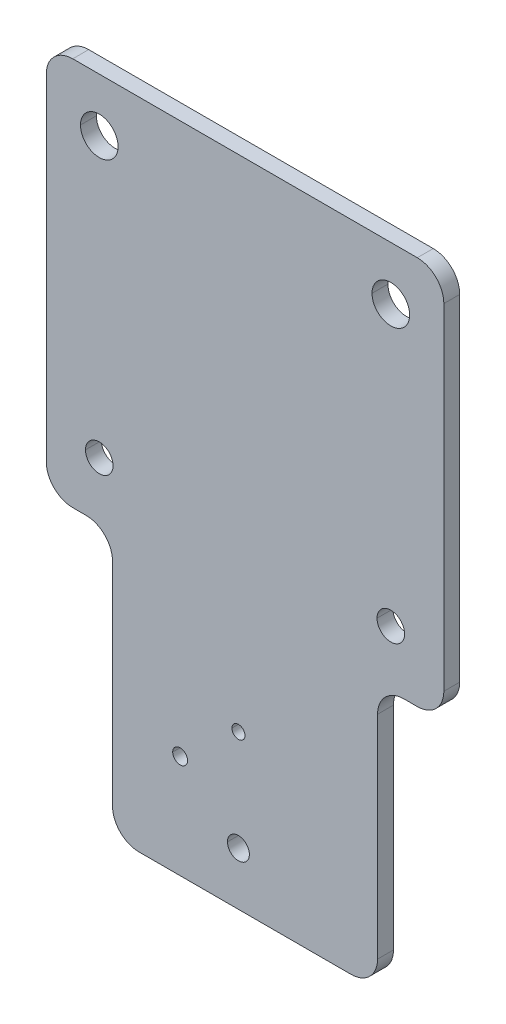
ISO-10303-21;
HEADER;
FILE_DESCRIPTION(('STEP AP214'),'2;1');
FILE_NAME('part.step','',(''),(''),'','','');
FILE_SCHEMA(('AUTOMOTIVE_DESIGN { 1 0 10303 214 1 1 1 1 }'));
ENDSEC;
DATA;
#1=APPLICATION_CONTEXT('core data for automotive mechanical design processes');
#2=APPLICATION_PROTOCOL_DEFINITION('international standard','automotive_design',2000,#1);
#3=PRODUCT_CONTEXT('',#1,'mechanical');
#4=PRODUCT('Part','Part','',(#3));
#5=PRODUCT_RELATED_PRODUCT_CATEGORY('part','',(#4));
#6=PRODUCT_DEFINITION_FORMATION('','',#4);
#7=PRODUCT_DEFINITION_CONTEXT('part definition',#1,'design');
#8=PRODUCT_DEFINITION('design','',#6,#7);
#9=PRODUCT_DEFINITION_SHAPE('','',#8);
#10=(LENGTH_UNIT() NAMED_UNIT(*) SI_UNIT(.MILLI.,.METRE.));
#11=(NAMED_UNIT(*) PLANE_ANGLE_UNIT() SI_UNIT($,.RADIAN.));
#12=(NAMED_UNIT(*) SI_UNIT($,.STERADIAN.) SOLID_ANGLE_UNIT());
#13=UNCERTAINTY_MEASURE_WITH_UNIT(LENGTH_MEASURE(1.E-05),#10,'distance_accuracy_value','');
#14=(GEOMETRIC_REPRESENTATION_CONTEXT(3) GLOBAL_UNCERTAINTY_ASSIGNED_CONTEXT((#13)) GLOBAL_UNIT_ASSIGNED_CONTEXT((#10,
#11,#12)) REPRESENTATION_CONTEXT('',''));
#15=CARTESIAN_POINT('',(0.,0.,0.));
#16=DIRECTION('',(0.,0.,1.));
#17=DIRECTION('',(1.,0.,0.));
#18=AXIS2_PLACEMENT_3D('',#15,#16,#17);
#19=CARTESIAN_POINT('',(-25.,-12.3885820247537,3.));
#20=DIRECTION('',(0.,0.,-1.));
#21=DIRECTION('',(-1.,0.,0.));
#22=AXIS2_PLACEMENT_3D('',#19,#20,#21);
#23=CYLINDRICAL_SURFACE('',#22,5.);
#24=CARTESIAN_POINT('',(-25.,-12.3885820247537,3.));
#25=DIRECTION('',(0.,0.,1.));
#26=DIRECTION('',(1.,0.,0.));
#27=AXIS2_PLACEMENT_3D('',#24,#25,#26);
#28=CIRCLE('',#27,5.);
#29=CARTESIAN_POINT('',(-25.,-7.38858202475368,3.));
#30=VERTEX_POINT('',#29);
#31=CARTESIAN_POINT('',(-30.,-12.3885820247537,3.));
#32=VERTEX_POINT('',#31);
#33=EDGE_CURVE('E261',#30,#32,#28,.T.);
#34=ORIENTED_EDGE('',*,*,#33,.F.);
#35=DIRECTION('',(0.,0.,1.));
#36=VECTOR('',#35,1.);
#37=CARTESIAN_POINT('',(-25.,-7.38858202475368,3.));
#38=LINE('',#37,#36);
#39=CARTESIAN_POINT('',(-25.,-7.38858202475368,0.));
#40=VERTEX_POINT('',#39);
#41=EDGE_CURVE('E377',#40,#30,#38,.T.);
#42=ORIENTED_EDGE('',*,*,#41,.F.);
#43=CARTESIAN_POINT('',(-25.,-12.3885820247537,0.));
#44=DIRECTION('',(0.,0.,-1.));
#45=DIRECTION('',(1.,0.,0.));
#46=AXIS2_PLACEMENT_3D('',#43,#44,#45);
#47=CIRCLE('',#46,5.);
#48=CARTESIAN_POINT('',(-30.,-12.3885820247537,0.));
#49=VERTEX_POINT('',#48);
#50=EDGE_CURVE('E316',#49,#40,#47,.T.);
#51=ORIENTED_EDGE('',*,*,#50,.F.);
#52=DIRECTION('',(0.,0.,-1.));
#53=VECTOR('',#52,1.);
#54=CARTESIAN_POINT('',(-30.,-12.3885820247537,3.));
#55=LINE('',#54,#53);
#56=EDGE_CURVE('E381',#32,#49,#55,.T.);
#57=ORIENTED_EDGE('',*,*,#56,.F.);
#58=EDGE_LOOP('',(#34,#42,#51,#57));
#59=FACE_BOUND('',#58,.T.);
#60=ADVANCED_FACE('F17',(#59),#23,.T.);
#61=CARTESIAN_POINT('',(40.,-12.3885820247537,3.));
#62=DIRECTION('',(0.,0.,-1.));
#63=DIRECTION('',(-1.,0.,0.));
#64=AXIS2_PLACEMENT_3D('',#61,#62,#63);
#65=CYLINDRICAL_SURFACE('',#64,5.);
#66=CARTESIAN_POINT('',(40.,-12.3885820247537,3.));
#67=DIRECTION('',(0.,0.,1.));
#68=DIRECTION('',(1.,0.,0.));
#69=AXIS2_PLACEMENT_3D('',#66,#67,#68);
#70=CIRCLE('',#69,5.);
#71=CARTESIAN_POINT('',(45.,-12.3885820247537,3.));
#72=VERTEX_POINT('',#71);
#73=CARTESIAN_POINT('',(40.,-7.38858202475368,3.));
#74=VERTEX_POINT('',#73);
#75=EDGE_CURVE('E237',#72,#74,#70,.T.);
#76=ORIENTED_EDGE('',*,*,#75,.F.);
#77=DIRECTION('',(0.,0.,1.));
#78=VECTOR('',#77,1.);
#79=CARTESIAN_POINT('',(45.,-12.3885820247537,3.));
#80=LINE('',#79,#78);
#81=CARTESIAN_POINT('',(45.,-12.3885820247537,0.));
#82=VERTEX_POINT('',#81);
#83=EDGE_CURVE('E222',#82,#72,#80,.T.);
#84=ORIENTED_EDGE('',*,*,#83,.F.);
#85=CARTESIAN_POINT('',(40.,-12.3885820247537,0.));
#86=DIRECTION('',(0.,0.,-1.));
#87=DIRECTION('',(1.,0.,0.));
#88=AXIS2_PLACEMENT_3D('',#85,#86,#87);
#89=CIRCLE('',#88,5.);
#90=CARTESIAN_POINT('',(40.,-7.38858202475368,0.));
#91=VERTEX_POINT('',#90);
#92=EDGE_CURVE('E298',#91,#82,#89,.T.);
#93=ORIENTED_EDGE('',*,*,#92,.F.);
#94=DIRECTION('',(0.,0.,-1.));
#95=VECTOR('',#94,1.);
#96=CARTESIAN_POINT('',(40.,-7.38858202475368,3.));
#97=LINE('',#96,#95);
#98=EDGE_CURVE('E234',#74,#91,#97,.T.);
#99=ORIENTED_EDGE('',*,*,#98,.F.);
#100=EDGE_LOOP('',(#76,#84,#93,#99));
#101=FACE_BOUND('',#100,.T.);
#102=ADVANCED_FACE('F238',(#101),#65,.T.);
#103=CARTESIAN_POINT('',(40.,-75.7250966848653,3.));
#104=DIRECTION('',(0.,0.,-1.));
#105=DIRECTION('',(-1.,0.,0.));
#106=AXIS2_PLACEMENT_3D('',#103,#104,#105);
#107=CYLINDRICAL_SURFACE('',#106,5.);
#108=CARTESIAN_POINT('',(40.,-75.7250966848653,3.));
#109=DIRECTION('',(0.,0.,1.));
#110=DIRECTION('',(1.,0.,0.));
#111=AXIS2_PLACEMENT_3D('',#108,#109,#110);
#112=CIRCLE('',#111,5.);
#113=CARTESIAN_POINT('',(40.,-80.7250966848653,3.));
#114=VERTEX_POINT('',#113);
#115=CARTESIAN_POINT('',(45.,-75.7250966848653,3.));
#116=VERTEX_POINT('',#115);
#117=EDGE_CURVE('E248',#114,#116,#112,.T.);
#118=ORIENTED_EDGE('',*,*,#117,.F.);
#119=DIRECTION('',(0.,0.,1.));
#120=VECTOR('',#119,1.);
#121=CARTESIAN_POINT('',(40.,-80.7250966848653,3.));
#122=LINE('',#121,#120);
#123=CARTESIAN_POINT('',(40.,-80.7250966848653,0.));
#124=VERTEX_POINT('',#123);
#125=EDGE_CURVE('E106',#124,#114,#122,.T.);
#126=ORIENTED_EDGE('',*,*,#125,.F.);
#127=CARTESIAN_POINT('',(40.,-75.7250966848653,0.));
#128=DIRECTION('',(0.,0.,-1.));
#129=DIRECTION('',(1.,0.,0.));
#130=AXIS2_PLACEMENT_3D('',#127,#128,#129);
#131=CIRCLE('',#130,5.);
#132=CARTESIAN_POINT('',(45.,-75.7250966848653,0.));
#133=VERTEX_POINT('',#132);
#134=EDGE_CURVE('E320',#133,#124,#131,.T.);
#135=ORIENTED_EDGE('',*,*,#134,.F.);
#136=DIRECTION('',(0.,0.,-1.));
#137=VECTOR('',#136,1.);
#138=CARTESIAN_POINT('',(45.,-75.7250966848653,3.));
#139=LINE('',#138,#137);
#140=EDGE_CURVE('E215',#116,#133,#139,.T.);
#141=ORIENTED_EDGE('',*,*,#140,.F.);
#142=EDGE_LOOP('',(#118,#126,#135,#141));
#143=FACE_BOUND('',#142,.T.);
#144=ADVANCED_FACE('F574',(#143),#107,.T.);
#145=CARTESIAN_POINT('',(37.5,-85.7250966848653,3.));
#146=DIRECTION('',(0.,0.,1.));
#147=DIRECTION('',(1.,0.,0.));
#148=AXIS2_PLACEMENT_3D('',#145,#146,#147);
#149=CYLINDRICAL_SURFACE('',#148,5.);
#150=CARTESIAN_POINT('',(37.5,-85.7250966848653,3.));
#151=DIRECTION('',(0.,0.,-1.));
#152=DIRECTION('',(1.,0.,0.));
#153=AXIS2_PLACEMENT_3D('',#150,#151,#152);
#154=CIRCLE('',#153,5.);
#155=CARTESIAN_POINT('',(32.5,-85.7250966848653,3.));
#156=VERTEX_POINT('',#155);
#157=CARTESIAN_POINT('',(37.5,-80.7250966848653,3.));
#158=VERTEX_POINT('',#157);
#159=EDGE_CURVE('E439',#156,#158,#154,.T.);
#160=ORIENTED_EDGE('',*,*,#159,.F.);
#161=DIRECTION('',(0.,0.,1.));
#162=VECTOR('',#161,1.);
#163=CARTESIAN_POINT('',(32.5,-85.7250966848653,3.));
#164=LINE('',#163,#162);
#165=CARTESIAN_POINT('',(32.5,-85.7250966848653,0.));
#166=VERTEX_POINT('',#165);
#167=EDGE_CURVE('E372',#166,#156,#164,.T.);
#168=ORIENTED_EDGE('',*,*,#167,.F.);
#169=CARTESIAN_POINT('',(37.5,-85.7250966848653,0.));
#170=DIRECTION('',(0.,0.,1.));
#171=DIRECTION('',(1.,0.,0.));
#172=AXIS2_PLACEMENT_3D('',#169,#170,#171);
#173=CIRCLE('',#172,5.);
#174=CARTESIAN_POINT('',(37.5,-80.7250966848653,0.));
#175=VERTEX_POINT('',#174);
#176=EDGE_CURVE('E327',#175,#166,#173,.T.);
#177=ORIENTED_EDGE('',*,*,#176,.F.);
#178=DIRECTION('',(0.,0.,-1.));
#179=VECTOR('',#178,1.);
#180=CARTESIAN_POINT('',(37.5,-80.7250966848653,0.));
#181=LINE('',#180,#179);
#182=EDGE_CURVE('E118',#158,#175,#181,.T.);
#183=ORIENTED_EDGE('',*,*,#182,.F.);
#184=EDGE_LOOP('',(#160,#168,#177,#183));
#185=FACE_BOUND('',#184,.T.);
#186=ADVANCED_FACE('F571',(#185),#149,.F.);
#187=CARTESIAN_POINT('',(27.5,-125.725096684865,3.));
#188=DIRECTION('',(0.,0.,-1.));
#189=DIRECTION('',(-1.,0.,0.));
#190=AXIS2_PLACEMENT_3D('',#187,#188,#189);
#191=CYLINDRICAL_SURFACE('',#190,5.);
#192=CARTESIAN_POINT('',(27.5,-125.725096684865,3.));
#193=DIRECTION('',(0.,0.,1.));
#194=DIRECTION('',(1.,0.,0.));
#195=AXIS2_PLACEMENT_3D('',#192,#193,#194);
#196=CIRCLE('',#195,5.);
#197=CARTESIAN_POINT('',(27.5,-130.725096684865,3.));
#198=VERTEX_POINT('',#197);
#199=CARTESIAN_POINT('',(32.5,-125.725096684865,3.));
#200=VERTEX_POINT('',#199);
#201=EDGE_CURVE('E462',#198,#200,#196,.T.);
#202=ORIENTED_EDGE('',*,*,#201,.F.);
#203=DIRECTION('',(0.,0.,1.));
#204=VECTOR('',#203,1.);
#205=CARTESIAN_POINT('',(27.5,-130.725096684865,3.));
#206=LINE('',#205,#204);
#207=CARTESIAN_POINT('',(27.5,-130.725096684865,0.));
#208=VERTEX_POINT('',#207);
#209=EDGE_CURVE('E367',#208,#198,#206,.T.);
#210=ORIENTED_EDGE('',*,*,#209,.F.);
#211=CARTESIAN_POINT('',(27.5,-125.725096684865,0.));
#212=DIRECTION('',(0.,0.,-1.));
#213=DIRECTION('',(1.,0.,0.));
#214=AXIS2_PLACEMENT_3D('',#211,#212,#213);
#215=CIRCLE('',#214,5.);
#216=CARTESIAN_POINT('',(32.5,-125.725096684865,0.));
#217=VERTEX_POINT('',#216);
#218=EDGE_CURVE('E336',#217,#208,#215,.T.);
#219=ORIENTED_EDGE('',*,*,#218,.F.);
#220=DIRECTION('',(0.,0.,-1.));
#221=VECTOR('',#220,1.);
#222=CARTESIAN_POINT('',(32.5,-125.725096684865,3.));
#223=LINE('',#222,#221);
#224=EDGE_CURVE('E40',#200,#217,#223,.T.);
#225=ORIENTED_EDGE('',*,*,#224,.F.);
#226=EDGE_LOOP('',(#202,#210,#219,#225));
#227=FACE_BOUND('',#226,.T.);
#228=ADVANCED_FACE('F582',(#227),#191,.T.);
#229=CARTESIAN_POINT('',(-25.,-75.7250966848653,3.));
#230=DIRECTION('',(0.,0.,-1.));
#231=DIRECTION('',(-1.,0.,0.));
#232=AXIS2_PLACEMENT_3D('',#229,#230,#231);
#233=CYLINDRICAL_SURFACE('',#232,5.);
#234=CARTESIAN_POINT('',(-25.,-75.7250966848653,3.));
#235=DIRECTION('',(0.,0.,1.));
#236=DIRECTION('',(1.,0.,0.));
#237=AXIS2_PLACEMENT_3D('',#234,#235,#236);
#238=CIRCLE('',#237,5.);
#239=CARTESIAN_POINT('',(-30.,-75.7250966848653,3.));
#240=VERTEX_POINT('',#239);
#241=CARTESIAN_POINT('',(-25.,-80.7250966848653,3.));
#242=VERTEX_POINT('',#241);
#243=EDGE_CURVE('E266',#240,#242,#238,.T.);
#244=ORIENTED_EDGE('',*,*,#243,.F.);
#245=DIRECTION('',(0.,0.,1.));
#246=VECTOR('',#245,1.);
#247=CARTESIAN_POINT('',(-30.,-75.7250966848653,3.));
#248=LINE('',#247,#246);
#249=CARTESIAN_POINT('',(-30.,-75.7250966848653,0.));
#250=VERTEX_POINT('',#249);
#251=EDGE_CURVE('E379',#250,#240,#248,.T.);
#252=ORIENTED_EDGE('',*,*,#251,.F.);
#253=CARTESIAN_POINT('',(-25.,-75.7250966848653,0.));
#254=DIRECTION('',(0.,0.,-1.));
#255=DIRECTION('',(1.,0.,0.));
#256=AXIS2_PLACEMENT_3D('',#253,#254,#255);
#257=CIRCLE('',#256,5.);
#258=CARTESIAN_POINT('',(-25.,-80.7250966848653,0.));
#259=VERTEX_POINT('',#258);
#260=EDGE_CURVE('E308',#259,#250,#257,.T.);
#261=ORIENTED_EDGE('',*,*,#260,.F.);
#262=DIRECTION('',(0.,0.,-1.));
#263=VECTOR('',#262,1.);
#264=CARTESIAN_POINT('',(-25.,-80.7250966848653,3.));
#265=LINE('',#264,#263);
#266=EDGE_CURVE('E11',#242,#259,#265,.T.);
#267=ORIENTED_EDGE('',*,*,#266,.F.);
#268=EDGE_LOOP('',(#244,#252,#261,#267));
#269=FACE_BOUND('',#268,.T.);
#270=ADVANCED_FACE('F663',(#269),#233,.T.);
#271=CARTESIAN_POINT('',(-12.5,-125.725096684865,3.));
#272=DIRECTION('',(0.,0.,-1.));
#273=DIRECTION('',(-1.,0.,0.));
#274=AXIS2_PLACEMENT_3D('',#271,#272,#273);
#275=CYLINDRICAL_SURFACE('',#274,5.);
#276=CARTESIAN_POINT('',(-12.5,-125.725096684865,3.));
#277=DIRECTION('',(0.,0.,1.));
#278=DIRECTION('',(1.,0.,0.));
#279=AXIS2_PLACEMENT_3D('',#276,#277,#278);
#280=CIRCLE('',#279,5.);
#281=CARTESIAN_POINT('',(-17.5,-125.725096684865,3.));
#282=VERTEX_POINT('',#281);
#283=CARTESIAN_POINT('',(-12.5,-130.725096684865,3.));
#284=VERTEX_POINT('',#283);
#285=EDGE_CURVE('E463',#282,#284,#280,.T.);
#286=ORIENTED_EDGE('',*,*,#285,.F.);
#287=DIRECTION('',(0.,0.,1.));
#288=VECTOR('',#287,1.);
#289=CARTESIAN_POINT('',(-17.5,-125.725096684865,3.));
#290=LINE('',#289,#288);
#291=CARTESIAN_POINT('',(-17.5,-125.725096684865,0.));
#292=VERTEX_POINT('',#291);
#293=EDGE_CURVE('E361',#292,#282,#290,.T.);
#294=ORIENTED_EDGE('',*,*,#293,.F.);
#295=CARTESIAN_POINT('',(-12.5,-125.725096684865,0.));
#296=DIRECTION('',(0.,0.,-1.));
#297=DIRECTION('',(1.,0.,0.));
#298=AXIS2_PLACEMENT_3D('',#295,#296,#297);
#299=CIRCLE('',#298,5.);
#300=CARTESIAN_POINT('',(-12.5,-130.725096684865,0.));
#301=VERTEX_POINT('',#300);
#302=EDGE_CURVE('E307',#301,#292,#299,.T.);
#303=ORIENTED_EDGE('',*,*,#302,.F.);
#304=DIRECTION('',(0.,0.,-1.));
#305=VECTOR('',#304,1.);
#306=CARTESIAN_POINT('',(-12.5,-130.725096684865,3.));
#307=LINE('',#306,#305);
#308=EDGE_CURVE('E364',#284,#301,#307,.T.);
#309=ORIENTED_EDGE('',*,*,#308,.F.);
#310=EDGE_LOOP('',(#286,#294,#303,#309));
#311=FACE_BOUND('',#310,.T.);
#312=ADVANCED_FACE('F660',(#311),#275,.T.);
#313=CARTESIAN_POINT('',(-22.5,-85.7250966848653,3.));
#314=DIRECTION('',(0.,0.,1.));
#315=DIRECTION('',(1.,0.,0.));
#316=AXIS2_PLACEMENT_3D('',#313,#314,#315);
#317=CYLINDRICAL_SURFACE('',#316,5.);
#318=CARTESIAN_POINT('',(-22.5,-85.7250966848653,3.));
#319=DIRECTION('',(0.,0.,-1.));
#320=DIRECTION('',(1.,0.,0.));
#321=AXIS2_PLACEMENT_3D('',#318,#319,#320);
#322=CIRCLE('',#321,5.);
#323=CARTESIAN_POINT('',(-22.5,-80.7250966848653,3.));
#324=VERTEX_POINT('',#323);
#325=CARTESIAN_POINT('',(-17.5,-85.7250966848653,3.));
#326=VERTEX_POINT('',#325);
#327=EDGE_CURVE('E274',#324,#326,#322,.T.);
#328=ORIENTED_EDGE('',*,*,#327,.F.);
#329=DIRECTION('',(0.,0.,1.));
#330=VECTOR('',#329,1.);
#331=CARTESIAN_POINT('',(-22.5,-80.7250966848653,3.));
#332=LINE('',#331,#330);
#333=CARTESIAN_POINT('',(-22.5,-80.7250966848653,0.));
#334=VERTEX_POINT('',#333);
#335=EDGE_CURVE('E20',#334,#324,#332,.T.);
#336=ORIENTED_EDGE('',*,*,#335,.F.);
#337=CARTESIAN_POINT('',(-22.5,-85.7250966848653,0.));
#338=DIRECTION('',(0.,0.,1.));
#339=DIRECTION('',(1.,0.,0.));
#340=AXIS2_PLACEMENT_3D('',#337,#338,#339);
#341=CIRCLE('',#340,5.);
#342=CARTESIAN_POINT('',(-17.5,-85.7250966848653,0.));
#343=VERTEX_POINT('',#342);
#344=EDGE_CURVE('E306',#343,#334,#341,.T.);
#345=ORIENTED_EDGE('',*,*,#344,.F.);
#346=DIRECTION('',(0.,0.,-1.));
#347=VECTOR('',#346,1.);
#348=CARTESIAN_POINT('',(-17.5,-85.7250966848653,0.));
#349=LINE('',#348,#347);
#350=EDGE_CURVE('E358',#326,#343,#349,.T.);
#351=ORIENTED_EDGE('',*,*,#350,.F.);
#352=EDGE_LOOP('',(#328,#336,#345,#351));
#353=FACE_BOUND('',#352,.T.);
#354=ADVANCED_FACE('F612',(#353),#317,.F.);
#355=CARTESIAN_POINT('',(35.,-17.4750966848652,3.));
#356=DIRECTION('',(0.,0.,-1.));
#357=DIRECTION('',(-1.,0.,0.));
#358=AXIS2_PLACEMENT_3D('',#355,#356,#357);
#359=CYLINDRICAL_SURFACE('',#358,3.55);
#360=DIRECTION('',(0.,0.,-1.));
#361=VECTOR('',#360,1.);
#362=CARTESIAN_POINT('',(38.55,-17.4750966848652,3.));
#363=LINE('',#362,#361);
#364=CARTESIAN_POINT('',(38.55,-17.4750966848652,3.));
#365=VERTEX_POINT('',#364);
#366=CARTESIAN_POINT('',(38.55,-17.4750966848652,0.));
#367=VERTEX_POINT('',#366);
#368=EDGE_CURVE('E400',#365,#367,#363,.T.);
#369=ORIENTED_EDGE('',*,*,#368,.F.);
#370=CARTESIAN_POINT('',(35.,-17.4750966848652,3.));
#371=DIRECTION('',(0.,0.,1.));
#372=DIRECTION('',(-1.,0.,0.));
#373=AXIS2_PLACEMENT_3D('',#370,#371,#372);
#374=CIRCLE('',#373,3.55);
#375=CARTESIAN_POINT('',(31.45,-17.4750966848652,3.));
#376=VERTEX_POINT('',#375);
#377=EDGE_CURVE('E496',#365,#376,#374,.T.);
#378=ORIENTED_EDGE('',*,*,#377,.T.);
#379=DIRECTION('',(0.,0.,-1.));
#380=VECTOR('',#379,1.);
#381=CARTESIAN_POINT('',(31.45,-17.4750966848652,3.));
#382=LINE('',#381,#380);
#383=CARTESIAN_POINT('',(31.45,-17.4750966848652,0.));
#384=VERTEX_POINT('',#383);
#385=EDGE_CURVE('E432',#376,#384,#382,.T.);
#386=ORIENTED_EDGE('',*,*,#385,.T.);
#387=CARTESIAN_POINT('',(35.,-17.4750966848652,0.));
#388=DIRECTION('',(0.,0.,1.));
#389=DIRECTION('',(-1.,0.,0.));
#390=AXIS2_PLACEMENT_3D('',#387,#388,#389);
#391=CIRCLE('',#390,3.55);
#392=EDGE_CURVE('E354',#367,#384,#391,.T.);
#393=ORIENTED_EDGE('',*,*,#392,.F.);
#394=EDGE_LOOP('',(#369,#378,#386,#393));
#395=FACE_BOUND('',#394,.T.);
#396=ADVANCED_FACE('F687',(#395),#359,.F.);
#397=CARTESIAN_POINT('',(-20.,-17.4750966848652,3.));
#398=DIRECTION('',(0.,0.,-1.));
#399=DIRECTION('',(-1.,0.,0.));
#400=AXIS2_PLACEMENT_3D('',#397,#398,#399);
#401=CYLINDRICAL_SURFACE('',#400,3.55);
#402=DIRECTION('',(0.,0.,-1.));
#403=VECTOR('',#402,1.);
#404=CARTESIAN_POINT('',(-16.45,-17.4750966848652,3.));
#405=LINE('',#404,#403);
#406=CARTESIAN_POINT('',(-16.45,-17.4750966848652,3.));
#407=VERTEX_POINT('',#406);
#408=CARTESIAN_POINT('',(-16.45,-17.4750966848652,0.));
#409=VERTEX_POINT('',#408);
#410=EDGE_CURVE('E443',#407,#409,#405,.T.);
#411=ORIENTED_EDGE('',*,*,#410,.F.);
#412=CARTESIAN_POINT('',(-20.,-17.4750966848652,3.));
#413=DIRECTION('',(0.,0.,1.));
#414=DIRECTION('',(-1.,0.,0.));
#415=AXIS2_PLACEMENT_3D('',#412,#413,#414);
#416=CIRCLE('',#415,3.55);
#417=CARTESIAN_POINT('',(-23.55,-17.4750966848652,3.));
#418=VERTEX_POINT('',#417);
#419=EDGE_CURVE('E284',#407,#418,#416,.T.);
#420=ORIENTED_EDGE('',*,*,#419,.T.);
#421=DIRECTION('',(0.,0.,-1.));
#422=VECTOR('',#421,1.);
#423=CARTESIAN_POINT('',(-23.55,-17.4750966848652,3.));
#424=LINE('',#423,#422);
#425=CARTESIAN_POINT('',(-23.55,-17.4750966848652,0.));
#426=VERTEX_POINT('',#425);
#427=EDGE_CURVE('E447',#418,#426,#424,.T.);
#428=ORIENTED_EDGE('',*,*,#427,.T.);
#429=CARTESIAN_POINT('',(-20.,-17.4750966848652,0.));
#430=DIRECTION('',(0.,0.,1.));
#431=DIRECTION('',(-1.,0.,0.));
#432=AXIS2_PLACEMENT_3D('',#429,#430,#431);
#433=CIRCLE('',#432,3.55);
#434=EDGE_CURVE('E280',#409,#426,#433,.T.);
#435=ORIENTED_EDGE('',*,*,#434,.F.);
#436=EDGE_LOOP('',(#411,#420,#428,#435));
#437=FACE_BOUND('',#436,.T.);
#438=ADVANCED_FACE('F683',(#437),#401,.F.);
#439=CARTESIAN_POINT('',(35.,-70.0750966848653,3.));
#440=DIRECTION('',(0.,0.,-1.));
#441=DIRECTION('',(-1.,0.,0.));
#442=AXIS2_PLACEMENT_3D('',#439,#440,#441);
#443=CYLINDRICAL_SURFACE('',#442,2.6);
#444=DIRECTION('',(0.,0.,-1.));
#445=VECTOR('',#444,1.);
#446=CARTESIAN_POINT('',(37.6,-70.0750966848653,3.));
#447=LINE('',#446,#445);
#448=CARTESIAN_POINT('',(37.6,-70.0750966848653,3.));
#449=VERTEX_POINT('',#448);
#450=CARTESIAN_POINT('',(37.6,-70.0750966848653,0.));
#451=VERTEX_POINT('',#450);
#452=EDGE_CURVE('E428',#449,#451,#447,.T.);
#453=ORIENTED_EDGE('',*,*,#452,.F.);
#454=CARTESIAN_POINT('',(35.,-70.0750966848653,3.));
#455=DIRECTION('',(0.,0.,1.));
#456=DIRECTION('',(-1.,0.,0.));
#457=AXIS2_PLACEMENT_3D('',#454,#455,#456);
#458=CIRCLE('',#457,2.6);
#459=CARTESIAN_POINT('',(32.4,-70.0750966848653,3.));
#460=VERTEX_POINT('',#459);
#461=EDGE_CURVE('E297',#449,#460,#458,.T.);
#462=ORIENTED_EDGE('',*,*,#461,.T.);
#463=DIRECTION('',(0.,0.,-1.));
#464=VECTOR('',#463,1.);
#465=CARTESIAN_POINT('',(32.4,-70.0750966848653,3.));
#466=LINE('',#465,#464);
#467=CARTESIAN_POINT('',(32.4,-70.0750966848653,0.));
#468=VERTEX_POINT('',#467);
#469=EDGE_CURVE('E427',#460,#468,#466,.T.);
#470=ORIENTED_EDGE('',*,*,#469,.T.);
#471=CARTESIAN_POINT('',(35.,-70.0750966848653,0.));
#472=DIRECTION('',(0.,0.,1.));
#473=DIRECTION('',(-1.,0.,0.));
#474=AXIS2_PLACEMENT_3D('',#471,#472,#473);
#475=CIRCLE('',#474,2.6);
#476=EDGE_CURVE('E350',#451,#468,#475,.T.);
#477=ORIENTED_EDGE('',*,*,#476,.F.);
#478=EDGE_LOOP('',(#453,#462,#470,#477));
#479=FACE_BOUND('',#478,.T.);
#480=ADVANCED_FACE('F679',(#479),#443,.F.);
#481=CARTESIAN_POINT('',(-20.,-70.0750966848653,3.));
#482=DIRECTION('',(0.,0.,-1.));
#483=DIRECTION('',(-1.,0.,0.));
#484=AXIS2_PLACEMENT_3D('',#481,#482,#483);
#485=CYLINDRICAL_SURFACE('',#484,2.6);
#486=DIRECTION('',(0.,0.,-1.));
#487=VECTOR('',#486,1.);
#488=CARTESIAN_POINT('',(-17.4,-70.0750966848653,3.));
#489=LINE('',#488,#487);
#490=CARTESIAN_POINT('',(-17.4,-70.0750966848653,3.));
#491=VERTEX_POINT('',#490);
#492=CARTESIAN_POINT('',(-17.4,-70.0750966848653,0.));
#493=VERTEX_POINT('',#492);
#494=EDGE_CURVE('E411',#491,#493,#489,.T.);
#495=ORIENTED_EDGE('',*,*,#494,.F.);
#496=CARTESIAN_POINT('',(-20.,-70.0750966848653,3.));
#497=DIRECTION('',(0.,0.,1.));
#498=DIRECTION('',(-1.,0.,0.));
#499=AXIS2_PLACEMENT_3D('',#496,#497,#498);
#500=CIRCLE('',#499,2.6);
#501=CARTESIAN_POINT('',(-22.6,-70.0750966848653,3.));
#502=VERTEX_POINT('',#501);
#503=EDGE_CURVE('E285',#491,#502,#500,.T.);
#504=ORIENTED_EDGE('',*,*,#503,.T.);
#505=DIRECTION('',(0.,0.,-1.));
#506=VECTOR('',#505,1.);
#507=CARTESIAN_POINT('',(-22.6,-70.0750966848653,3.));
#508=LINE('',#507,#506);
#509=CARTESIAN_POINT('',(-22.6,-70.0750966848653,0.));
#510=VERTEX_POINT('',#509);
#511=EDGE_CURVE('E406',#502,#510,#508,.T.);
#512=ORIENTED_EDGE('',*,*,#511,.T.);
#513=CARTESIAN_POINT('',(-20.,-70.0750966848653,0.));
#514=DIRECTION('',(0.,0.,1.));
#515=DIRECTION('',(-1.,0.,0.));
#516=AXIS2_PLACEMENT_3D('',#513,#514,#515);
#517=CIRCLE('',#516,2.6);
#518=EDGE_CURVE('E275',#493,#510,#517,.T.);
#519=ORIENTED_EDGE('',*,*,#518,.F.);
#520=EDGE_LOOP('',(#495,#504,#512,#519));
#521=FACE_BOUND('',#520,.T.);
#522=ADVANCED_FACE('F675',(#521),#485,.F.);
#523=CARTESIAN_POINT('',(-4.75,-111.225096684865,3.));
#524=DIRECTION('',(0.,0.,-1.));
#525=DIRECTION('',(-1.,0.,0.));
#526=AXIS2_PLACEMENT_3D('',#523,#524,#525);
#527=CYLINDRICAL_SURFACE('',#526,1.4);
#528=DIRECTION('',(0.,0.,-1.));
#529=VECTOR('',#528,1.);
#530=CARTESIAN_POINT('',(-3.35,-111.225096684865,3.));
#531=LINE('',#530,#529);
#532=CARTESIAN_POINT('',(-3.35,-111.225096684865,3.));
#533=VERTEX_POINT('',#532);
#534=CARTESIAN_POINT('',(-3.35,-111.225096684865,0.));
#535=VERTEX_POINT('',#534);
#536=EDGE_CURVE('E405',#533,#535,#531,.T.);
#537=ORIENTED_EDGE('',*,*,#536,.F.);
#538=CARTESIAN_POINT('',(-4.75,-111.225096684865,3.));
#539=DIRECTION('',(0.,0.,1.));
#540=DIRECTION('',(-1.,0.,0.));
#541=AXIS2_PLACEMENT_3D('',#538,#539,#540);
#542=CIRCLE('',#541,1.4);
#543=CARTESIAN_POINT('',(-6.15,-111.225096684865,3.));
#544=VERTEX_POINT('',#543);
#545=EDGE_CURVE('E293',#533,#544,#542,.T.);
#546=ORIENTED_EDGE('',*,*,#545,.T.);
#547=DIRECTION('',(0.,0.,-1.));
#548=VECTOR('',#547,1.);
#549=CARTESIAN_POINT('',(-6.15,-111.225096684865,3.));
#550=LINE('',#549,#548);
#551=CARTESIAN_POINT('',(-6.15,-111.225096684865,0.));
#552=VERTEX_POINT('',#551);
#553=EDGE_CURVE('E486',#544,#552,#550,.T.);
#554=ORIENTED_EDGE('',*,*,#553,.T.);
#555=CARTESIAN_POINT('',(-4.75,-111.225096684865,0.));
#556=DIRECTION('',(0.,0.,1.));
#557=DIRECTION('',(-1.,0.,0.));
#558=AXIS2_PLACEMENT_3D('',#555,#556,#557);
#559=CIRCLE('',#558,1.4);
#560=EDGE_CURVE('E349',#535,#552,#559,.T.);
#561=ORIENTED_EDGE('',*,*,#560,.F.);
#562=EDGE_LOOP('',(#537,#546,#554,#561));
#563=FACE_BOUND('',#562,.T.);
#564=ADVANCED_FACE('F671',(#563),#527,.F.);
#565=CARTESIAN_POINT('',(6.25,-120.725096684865,3.));
#566=DIRECTION('',(0.,0.,-1.));
#567=DIRECTION('',(-1.,0.,0.));
#568=AXIS2_PLACEMENT_3D('',#565,#566,#567);
#569=CYLINDRICAL_SURFACE('',#568,2.065);
#570=DIRECTION('',(0.,0.,-1.));
#571=VECTOR('',#570,1.);
#572=CARTESIAN_POINT('',(8.315,-120.725096684865,3.));
#573=LINE('',#572,#571);
#574=CARTESIAN_POINT('',(8.315,-120.725096684865,3.));
#575=VERTEX_POINT('',#574);
#576=CARTESIAN_POINT('',(8.315,-120.725096684865,0.));
#577=VERTEX_POINT('',#576);
#578=EDGE_CURVE('E504',#575,#577,#573,.T.);
#579=ORIENTED_EDGE('',*,*,#578,.F.);
#580=CARTESIAN_POINT('',(6.25,-120.725096684865,3.));
#581=DIRECTION('',(0.,0.,1.));
#582=DIRECTION('',(-1.,0.,0.));
#583=AXIS2_PLACEMENT_3D('',#580,#581,#582);
#584=CIRCLE('',#583,2.065);
#585=CARTESIAN_POINT('',(4.185,-120.725096684865,3.));
#586=VERTEX_POINT('',#585);
#587=EDGE_CURVE('E289',#575,#586,#584,.T.);
#588=ORIENTED_EDGE('',*,*,#587,.T.);
#589=DIRECTION('',(0.,0.,-1.));
#590=VECTOR('',#589,1.);
#591=CARTESIAN_POINT('',(4.185,-120.725096684865,3.));
#592=LINE('',#591,#590);
#593=CARTESIAN_POINT('',(4.185,-120.725096684865,0.));
#594=VERTEX_POINT('',#593);
#595=EDGE_CURVE('E469',#586,#594,#592,.T.);
#596=ORIENTED_EDGE('',*,*,#595,.T.);
#597=CARTESIAN_POINT('',(6.25,-120.725096684865,0.));
#598=DIRECTION('',(0.,0.,1.));
#599=DIRECTION('',(-1.,0.,0.));
#600=AXIS2_PLACEMENT_3D('',#597,#598,#599);
#601=CIRCLE('',#600,2.065);
#602=EDGE_CURVE('E279',#577,#594,#601,.T.);
#603=ORIENTED_EDGE('',*,*,#602,.F.);
#604=EDGE_LOOP('',(#579,#588,#596,#603));
#605=FACE_BOUND('',#604,.T.);
#606=ADVANCED_FACE('F667',(#605),#569,.F.);
#607=CARTESIAN_POINT('',(6.25,-101.725096684865,3.));
#608=DIRECTION('',(0.,0.,-1.));
#609=DIRECTION('',(-1.,0.,0.));
#610=AXIS2_PLACEMENT_3D('',#607,#608,#609);
#611=CYLINDRICAL_SURFACE('',#610,1.23);
#612=DIRECTION('',(0.,0.,-1.));
#613=VECTOR('',#612,1.);
#614=CARTESIAN_POINT('',(7.48,-101.725096684865,3.));
#615=LINE('',#614,#613);
#616=CARTESIAN_POINT('',(7.48,-101.725096684865,3.));
#617=VERTEX_POINT('',#616);
#618=CARTESIAN_POINT('',(7.48,-101.725096684865,0.));
#619=VERTEX_POINT('',#618);
#620=EDGE_CURVE('E468',#617,#619,#615,.T.);
#621=ORIENTED_EDGE('',*,*,#620,.F.);
#622=CARTESIAN_POINT('',(6.25,-101.725096684865,3.));
#623=DIRECTION('',(0.,0.,1.));
#624=DIRECTION('',(-1.,0.,0.));
#625=AXIS2_PLACEMENT_3D('',#622,#623,#624);
#626=CIRCLE('',#625,1.23);
#627=CARTESIAN_POINT('',(5.02,-101.725096684865,3.));
#628=VERTEX_POINT('',#627);
#629=EDGE_CURVE('E290',#617,#628,#626,.T.);
#630=ORIENTED_EDGE('',*,*,#629,.T.);
#631=DIRECTION('',(0.,0.,-1.));
#632=VECTOR('',#631,1.);
#633=CARTESIAN_POINT('',(5.02,-101.725096684865,3.));
#634=LINE('',#633,#632);
#635=CARTESIAN_POINT('',(5.02,-101.725096684865,0.));
#636=VERTEX_POINT('',#635);
#637=EDGE_CURVE('E530',#628,#636,#634,.T.);
#638=ORIENTED_EDGE('',*,*,#637,.T.);
#639=CARTESIAN_POINT('',(6.25,-101.725096684865,0.));
#640=DIRECTION('',(0.,0.,1.));
#641=DIRECTION('',(-1.,0.,0.));
#642=AXIS2_PLACEMENT_3D('',#639,#640,#641);
#643=CIRCLE('',#642,1.23);
#644=EDGE_CURVE('E343',#619,#636,#643,.T.);
#645=ORIENTED_EDGE('',*,*,#644,.F.);
#646=EDGE_LOOP('',(#621,#630,#638,#645));
#647=FACE_BOUND('',#646,.T.);
#648=ADVANCED_FACE('F607',(#647),#611,.F.);
#649=CARTESIAN_POINT('',(-17.5,-80.7250966848653,3.));
#650=DIRECTION('',(0.,1.,0.));
#651=DIRECTION('',(1.,0.,0.));
#652=AXIS2_PLACEMENT_3D('',#649,#650,#651);
#653=PLANE('',#652);
#654=DIRECTION('',(1.,0.,0.));
#655=VECTOR('',#654,1.);
#656=CARTESIAN_POINT('',(-17.5,-80.7250966848653,0.));
#657=LINE('',#656,#655);
#658=EDGE_CURVE('E313',#259,#334,#657,.T.);
#659=ORIENTED_EDGE('',*,*,#658,.T.);
#660=ORIENTED_EDGE('',*,*,#335,.T.);
#661=DIRECTION('',(1.,0.,0.));
#662=VECTOR('',#661,1.);
#663=CARTESIAN_POINT('',(-17.5,-80.7250966848653,3.));
#664=LINE('',#663,#662);
#665=EDGE_CURVE('E270',#242,#324,#664,.T.);
#666=ORIENTED_EDGE('',*,*,#665,.F.);
#667=ORIENTED_EDGE('',*,*,#266,.T.);
#668=EDGE_LOOP('',(#659,#660,#666,#667));
#669=FACE_BOUND('',#668,.T.);
#670=ADVANCED_FACE('F600',(#669),#653,.F.);
#671=CARTESIAN_POINT('',(-30.,-80.7250966848653,3.));
#672=DIRECTION('',(1.,0.,0.));
#673=DIRECTION('',(0.,1.,0.));
#674=AXIS2_PLACEMENT_3D('',#671,#672,#673);
#675=PLANE('',#674);
#676=DIRECTION('',(0.,-1.,0.));
#677=VECTOR('',#676,1.);
#678=CARTESIAN_POINT('',(-30.,-80.7250966848653,0.));
#679=LINE('',#678,#677);
#680=EDGE_CURVE('E312',#49,#250,#679,.T.);
#681=ORIENTED_EDGE('',*,*,#680,.T.);
#682=ORIENTED_EDGE('',*,*,#251,.T.);
#683=DIRECTION('',(0.,-1.,0.));
#684=VECTOR('',#683,1.);
#685=CARTESIAN_POINT('',(-30.,-80.7250966848653,3.));
#686=LINE('',#685,#684);
#687=EDGE_CURVE('E265',#32,#240,#686,.T.);
#688=ORIENTED_EDGE('',*,*,#687,.F.);
#689=ORIENTED_EDGE('',*,*,#56,.T.);
#690=EDGE_LOOP('',(#681,#682,#688,#689));
#691=FACE_BOUND('',#690,.T.);
#692=ADVANCED_FACE('F598',(#691),#675,.F.);
#693=CARTESIAN_POINT('',(-30.,-7.38858202475368,3.));
#694=DIRECTION('',(0.,-1.,0.));
#695=DIRECTION('',(0.,0.,-1.));
#696=AXIS2_PLACEMENT_3D('',#693,#694,#695);
#697=PLANE('',#696);
#698=DIRECTION('',(-1.,0.,0.));
#699=VECTOR('',#698,1.);
#700=CARTESIAN_POINT('',(-30.,-7.38858202475368,3.));
#701=LINE('',#700,#699);
#702=EDGE_CURVE('E243',#74,#30,#701,.T.);
#703=ORIENTED_EDGE('',*,*,#702,.F.);
#704=ORIENTED_EDGE('',*,*,#98,.T.);
#705=DIRECTION('',(-1.,0.,0.));
#706=VECTOR('',#705,1.);
#707=CARTESIAN_POINT('',(-30.,-7.38858202475368,0.));
#708=LINE('',#707,#706);
#709=EDGE_CURVE('E301',#91,#40,#708,.T.);
#710=ORIENTED_EDGE('',*,*,#709,.T.);
#711=ORIENTED_EDGE('',*,*,#41,.T.);
#712=EDGE_LOOP('',(#703,#704,#710,#711));
#713=FACE_BOUND('',#712,.T.);
#714=ADVANCED_FACE('F590',(#713),#697,.F.);
#715=CARTESIAN_POINT('',(45.,-80.7250966848653,3.));
#716=DIRECTION('',(-1.,0.,0.));
#717=DIRECTION('',(0.,1.,0.));
#718=AXIS2_PLACEMENT_3D('',#715,#716,#717);
#719=PLANE('',#718);
#720=DIRECTION('',(0.,1.,0.));
#721=VECTOR('',#720,1.);
#722=CARTESIAN_POINT('',(45.,-80.7250966848653,3.));
#723=LINE('',#722,#721);
#724=EDGE_CURVE('E226',#116,#72,#723,.T.);
#725=ORIENTED_EDGE('',*,*,#724,.F.);
#726=ORIENTED_EDGE('',*,*,#140,.T.);
#727=DIRECTION('',(0.,1.,0.));
#728=VECTOR('',#727,1.);
#729=CARTESIAN_POINT('',(45.,-80.7250966848653,0.));
#730=LINE('',#729,#728);
#731=EDGE_CURVE('E229',#133,#82,#730,.T.);
#732=ORIENTED_EDGE('',*,*,#731,.T.);
#733=ORIENTED_EDGE('',*,*,#83,.T.);
#734=EDGE_LOOP('',(#725,#726,#732,#733));
#735=FACE_BOUND('',#734,.T.);
#736=ADVANCED_FACE('F224',(#735),#719,.F.);
#737=CARTESIAN_POINT('',(45.,-80.7250966848653,3.));
#738=DIRECTION('',(0.,1.,0.));
#739=DIRECTION('',(1.,0.,0.));
#740=AXIS2_PLACEMENT_3D('',#737,#738,#739);
#741=PLANE('',#740);
#742=DIRECTION('',(1.,0.,0.));
#743=VECTOR('',#742,1.);
#744=CARTESIAN_POINT('',(45.,-80.7250966848653,3.));
#745=LINE('',#744,#743);
#746=EDGE_CURVE('E255',#158,#114,#745,.T.);
#747=ORIENTED_EDGE('',*,*,#746,.F.);
#748=ORIENTED_EDGE('',*,*,#182,.T.);
#749=DIRECTION('',(1.,0.,0.));
#750=VECTOR('',#749,1.);
#751=CARTESIAN_POINT('',(45.,-80.7250966848653,0.));
#752=LINE('',#751,#750);
#753=EDGE_CURVE('E324',#175,#124,#752,.T.);
#754=ORIENTED_EDGE('',*,*,#753,.T.);
#755=ORIENTED_EDGE('',*,*,#125,.T.);
#756=EDGE_LOOP('',(#747,#748,#754,#755));
#757=FACE_BOUND('',#756,.T.);
#758=ADVANCED_FACE('F573',(#757),#741,.F.);
#759=CARTESIAN_POINT('',(32.5,-80.7250966848653,3.));
#760=DIRECTION('',(-1.,0.,0.));
#761=DIRECTION('',(0.,0.,1.));
#762=AXIS2_PLACEMENT_3D('',#759,#760,#761);
#763=PLANE('',#762);
#764=DIRECTION('',(0.,1.,0.));
#765=VECTOR('',#764,1.);
#766=CARTESIAN_POINT('',(32.5,-80.7250966848653,3.));
#767=LINE('',#766,#765);
#768=EDGE_CURVE('E543',#200,#156,#767,.T.);
#769=ORIENTED_EDGE('',*,*,#768,.F.);
#770=ORIENTED_EDGE('',*,*,#224,.T.);
#771=DIRECTION('',(0.,1.,0.));
#772=VECTOR('',#771,1.);
#773=CARTESIAN_POINT('',(32.5,-80.7250966848653,0.));
#774=LINE('',#773,#772);
#775=EDGE_CURVE('E331',#217,#166,#774,.T.);
#776=ORIENTED_EDGE('',*,*,#775,.T.);
#777=ORIENTED_EDGE('',*,*,#167,.T.);
#778=EDGE_LOOP('',(#769,#770,#776,#777));
#779=FACE_BOUND('',#778,.T.);
#780=ADVANCED_FACE('F634',(#779),#763,.F.);
#781=CARTESIAN_POINT('',(-17.5,-130.725096684865,3.));
#782=DIRECTION('',(0.,1.,0.));
#783=DIRECTION('',(1.,0.,0.));
#784=AXIS2_PLACEMENT_3D('',#781,#782,#783);
#785=PLANE('',#784);
#786=DIRECTION('',(1.,0.,0.));
#787=VECTOR('',#786,1.);
#788=CARTESIAN_POINT('',(-17.5,-130.725096684865,3.));
#789=LINE('',#788,#787);
#790=EDGE_CURVE('E458',#284,#198,#789,.T.);
#791=ORIENTED_EDGE('',*,*,#790,.F.);
#792=ORIENTED_EDGE('',*,*,#308,.T.);
#793=DIRECTION('',(1.,0.,0.));
#794=VECTOR('',#793,1.);
#795=CARTESIAN_POINT('',(-17.5,-130.725096684865,0.));
#796=LINE('',#795,#794);
#797=EDGE_CURVE('E500',#301,#208,#796,.T.);
#798=ORIENTED_EDGE('',*,*,#797,.T.);
#799=ORIENTED_EDGE('',*,*,#209,.T.);
#800=EDGE_LOOP('',(#791,#792,#798,#799));
#801=FACE_BOUND('',#800,.T.);
#802=ADVANCED_FACE('F637',(#801),#785,.F.);
#803=CARTESIAN_POINT('',(-17.5,-80.7250966848653,3.));
#804=DIRECTION('',(1.,0.,0.));
#805=DIRECTION('',(0.,1.,0.));
#806=AXIS2_PLACEMENT_3D('',#803,#804,#805);
#807=PLANE('',#806);
#808=DIRECTION('',(0.,-1.,0.));
#809=VECTOR('',#808,1.);
#810=CARTESIAN_POINT('',(-17.5,-80.7250966848653,3.));
#811=LINE('',#810,#809);
#812=EDGE_CURVE('E536',#326,#282,#811,.T.);
#813=ORIENTED_EDGE('',*,*,#812,.F.);
#814=ORIENTED_EDGE('',*,*,#350,.T.);
#815=DIRECTION('',(0.,-1.,0.));
#816=VECTOR('',#815,1.);
#817=CARTESIAN_POINT('',(-17.5,-80.7250966848653,0.));
#818=LINE('',#817,#816);
#819=EDGE_CURVE('E302',#343,#292,#818,.T.);
#820=ORIENTED_EDGE('',*,*,#819,.T.);
#821=ORIENTED_EDGE('',*,*,#293,.T.);
#822=EDGE_LOOP('',(#813,#814,#820,#821));
#823=FACE_BOUND('',#822,.T.);
#824=ADVANCED_FACE('F644',(#823),#807,.F.);
#825=CARTESIAN_POINT('',(0.,0.,0.));
#826=DIRECTION('',(0.,0.,1.));
#827=DIRECTION('',(1.,0.,0.));
#828=AXIS2_PLACEMENT_3D('',#825,#826,#827);
#829=PLANE('',#828);
#830=CARTESIAN_POINT('',(35.,-17.4750966848652,0.));
#831=DIRECTION('',(0.,0.,1.));
#832=DIRECTION('',(-1.,0.,0.));
#833=AXIS2_PLACEMENT_3D('',#830,#831,#832);
#834=CIRCLE('',#833,3.55);
#835=EDGE_CURVE('E419',#384,#367,#834,.T.);
#836=ORIENTED_EDGE('',*,*,#835,.T.);
#837=ORIENTED_EDGE('',*,*,#392,.T.);
#838=EDGE_LOOP('',(#836,#837));
#839=FACE_BOUND('',#838,.T.);
#840=CARTESIAN_POINT('',(35.,-70.0750966848653,0.));
#841=DIRECTION('',(0.,0.,1.));
#842=DIRECTION('',(-1.,0.,0.));
#843=AXIS2_PLACEMENT_3D('',#840,#841,#842);
#844=CIRCLE('',#843,2.6);
#845=EDGE_CURVE('E423',#468,#451,#844,.T.);
#846=ORIENTED_EDGE('',*,*,#845,.T.);
#847=ORIENTED_EDGE('',*,*,#476,.T.);
#848=EDGE_LOOP('',(#846,#847));
#849=FACE_BOUND('',#848,.T.);
#850=CARTESIAN_POINT('',(-4.75,-111.225096684865,0.));
#851=DIRECTION('',(0.,0.,1.));
#852=DIRECTION('',(-1.,0.,0.));
#853=AXIS2_PLACEMENT_3D('',#850,#851,#852);
#854=CIRCLE('',#853,1.4);
#855=EDGE_CURVE('E482',#552,#535,#854,.T.);
#856=ORIENTED_EDGE('',*,*,#855,.T.);
#857=ORIENTED_EDGE('',*,*,#560,.T.);
#858=EDGE_LOOP('',(#856,#857));
#859=FACE_BOUND('',#858,.T.);
#860=CARTESIAN_POINT('',(6.25,-101.725096684865,0.));
#861=DIRECTION('',(0.,0.,1.));
#862=DIRECTION('',(-1.,0.,0.));
#863=AXIS2_PLACEMENT_3D('',#860,#861,#862);
#864=CIRCLE('',#863,1.23);
#865=EDGE_CURVE('E526',#636,#619,#864,.T.);
#866=ORIENTED_EDGE('',*,*,#865,.T.);
#867=ORIENTED_EDGE('',*,*,#644,.T.);
#868=EDGE_LOOP('',(#866,#867));
#869=FACE_BOUND('',#868,.T.);
#870=CARTESIAN_POINT('',(6.25,-120.725096684865,0.));
#871=DIRECTION('',(0.,0.,1.));
#872=DIRECTION('',(-1.,0.,0.));
#873=AXIS2_PLACEMENT_3D('',#870,#871,#872);
#874=CIRCLE('',#873,2.065);
#875=EDGE_CURVE('E508',#594,#577,#874,.T.);
#876=ORIENTED_EDGE('',*,*,#875,.T.);
#877=ORIENTED_EDGE('',*,*,#602,.T.);
#878=EDGE_LOOP('',(#876,#877));
#879=FACE_BOUND('',#878,.T.);
#880=CARTESIAN_POINT('',(-20.,-70.0750966848653,0.));
#881=DIRECTION('',(0.,0.,1.));
#882=DIRECTION('',(-1.,0.,0.));
#883=AXIS2_PLACEMENT_3D('',#880,#881,#882);
#884=CIRCLE('',#883,2.6);
#885=EDGE_CURVE('E407',#510,#493,#884,.T.);
#886=ORIENTED_EDGE('',*,*,#885,.T.);
#887=ORIENTED_EDGE('',*,*,#518,.T.);
#888=EDGE_LOOP('',(#886,#887));
#889=FACE_BOUND('',#888,.T.);
#890=CARTESIAN_POINT('',(-20.,-17.4750966848652,0.));
#891=DIRECTION('',(0.,0.,1.));
#892=DIRECTION('',(-1.,0.,0.));
#893=AXIS2_PLACEMENT_3D('',#890,#891,#892);
#894=CIRCLE('',#893,3.55);
#895=EDGE_CURVE('E395',#426,#409,#894,.T.);
#896=ORIENTED_EDGE('',*,*,#895,.T.);
#897=ORIENTED_EDGE('',*,*,#434,.T.);
#898=EDGE_LOOP('',(#896,#897));
#899=FACE_BOUND('',#898,.T.);
#900=ORIENTED_EDGE('',*,*,#797,.F.);
#901=ORIENTED_EDGE('',*,*,#302,.T.);
#902=ORIENTED_EDGE('',*,*,#819,.F.);
#903=ORIENTED_EDGE('',*,*,#344,.T.);
#904=ORIENTED_EDGE('',*,*,#658,.F.);
#905=ORIENTED_EDGE('',*,*,#260,.T.);
#906=ORIENTED_EDGE('',*,*,#680,.F.);
#907=ORIENTED_EDGE('',*,*,#50,.T.);
#908=ORIENTED_EDGE('',*,*,#709,.F.);
#909=ORIENTED_EDGE('',*,*,#92,.T.);
#910=ORIENTED_EDGE('',*,*,#731,.F.);
#911=ORIENTED_EDGE('',*,*,#134,.T.);
#912=ORIENTED_EDGE('',*,*,#753,.F.);
#913=ORIENTED_EDGE('',*,*,#176,.T.);
#914=ORIENTED_EDGE('',*,*,#775,.F.);
#915=ORIENTED_EDGE('',*,*,#218,.T.);
#916=EDGE_LOOP('',(#900,#901,#902,#903,#904,#905,#906,#907,#908,#909,#910,#911,#912,#913,#914,#915));
#917=FACE_BOUND('',#916,.T.);
#918=ADVANCED_FACE('F595',(#839,#849,#859,#869,#879,#889,#899,#917),#829,.F.);
#919=CARTESIAN_POINT('',(0.,0.,3.));
#920=DIRECTION('',(0.,0.,1.));
#921=DIRECTION('',(1.,0.,0.));
#922=AXIS2_PLACEMENT_3D('',#919,#920,#921);
#923=PLANE('',#922);
#924=CARTESIAN_POINT('',(35.,-17.4750966848652,3.));
#925=DIRECTION('',(0.,0.,1.));
#926=DIRECTION('',(-1.,0.,0.));
#927=AXIS2_PLACEMENT_3D('',#924,#925,#926);
#928=CIRCLE('',#927,3.55);
#929=EDGE_CURVE('E396',#376,#365,#928,.T.);
#930=ORIENTED_EDGE('',*,*,#929,.F.);
#931=ORIENTED_EDGE('',*,*,#377,.F.);
#932=EDGE_LOOP('',(#930,#931));
#933=FACE_BOUND('',#932,.T.);
#934=CARTESIAN_POINT('',(35.,-70.0750966848653,3.));
#935=DIRECTION('',(0.,0.,1.));
#936=DIRECTION('',(-1.,0.,0.));
#937=AXIS2_PLACEMENT_3D('',#934,#935,#936);
#938=CIRCLE('',#937,2.6);
#939=EDGE_CURVE('E451',#460,#449,#938,.T.);
#940=ORIENTED_EDGE('',*,*,#939,.F.);
#941=ORIENTED_EDGE('',*,*,#461,.F.);
#942=EDGE_LOOP('',(#940,#941));
#943=FACE_BOUND('',#942,.T.);
#944=CARTESIAN_POINT('',(-4.75,-111.225096684865,3.));
#945=DIRECTION('',(0.,0.,1.));
#946=DIRECTION('',(-1.,0.,0.));
#947=AXIS2_PLACEMENT_3D('',#944,#945,#946);
#948=CIRCLE('',#947,1.4);
#949=EDGE_CURVE('E401',#544,#533,#948,.T.);
#950=ORIENTED_EDGE('',*,*,#949,.F.);
#951=ORIENTED_EDGE('',*,*,#545,.F.);
#952=EDGE_LOOP('',(#950,#951));
#953=FACE_BOUND('',#952,.T.);
#954=CARTESIAN_POINT('',(6.25,-101.725096684865,3.));
#955=DIRECTION('',(0.,0.,1.));
#956=DIRECTION('',(-1.,0.,0.));
#957=AXIS2_PLACEMENT_3D('',#954,#955,#956);
#958=CIRCLE('',#957,1.23);
#959=EDGE_CURVE('E464',#628,#617,#958,.T.);
#960=ORIENTED_EDGE('',*,*,#959,.F.);
#961=ORIENTED_EDGE('',*,*,#629,.F.);
#962=EDGE_LOOP('',(#960,#961));
#963=FACE_BOUND('',#962,.T.);
#964=CARTESIAN_POINT('',(6.25,-120.725096684865,3.));
#965=DIRECTION('',(0.,0.,1.));
#966=DIRECTION('',(-1.,0.,0.));
#967=AXIS2_PLACEMENT_3D('',#964,#965,#966);
#968=CIRCLE('',#967,2.065);
#969=EDGE_CURVE('E495',#586,#575,#968,.T.);
#970=ORIENTED_EDGE('',*,*,#969,.F.);
#971=ORIENTED_EDGE('',*,*,#587,.F.);
#972=EDGE_LOOP('',(#970,#971));
#973=FACE_BOUND('',#972,.T.);
#974=CARTESIAN_POINT('',(-20.,-70.0750966848653,3.));
#975=DIRECTION('',(0.,0.,1.));
#976=DIRECTION('',(-1.,0.,0.));
#977=AXIS2_PLACEMENT_3D('',#974,#975,#976);
#978=CIRCLE('',#977,2.6);
#979=EDGE_CURVE('E415',#502,#491,#978,.T.);
#980=ORIENTED_EDGE('',*,*,#979,.F.);
#981=ORIENTED_EDGE('',*,*,#503,.F.);
#982=EDGE_LOOP('',(#980,#981));
#983=FACE_BOUND('',#982,.T.);
#984=CARTESIAN_POINT('',(-20.,-17.4750966848652,3.));
#985=DIRECTION('',(0.,0.,1.));
#986=DIRECTION('',(-1.,0.,0.));
#987=AXIS2_PLACEMENT_3D('',#984,#985,#986);
#988=CIRCLE('',#987,3.55);
#989=EDGE_CURVE('E436',#418,#407,#988,.T.);
#990=ORIENTED_EDGE('',*,*,#989,.F.);
#991=ORIENTED_EDGE('',*,*,#419,.F.);
#992=EDGE_LOOP('',(#990,#991));
#993=FACE_BOUND('',#992,.T.);
#994=ORIENTED_EDGE('',*,*,#812,.T.);
#995=ORIENTED_EDGE('',*,*,#285,.T.);
#996=ORIENTED_EDGE('',*,*,#790,.T.);
#997=ORIENTED_EDGE('',*,*,#201,.T.);
#998=ORIENTED_EDGE('',*,*,#768,.T.);
#999=ORIENTED_EDGE('',*,*,#159,.T.);
#1000=ORIENTED_EDGE('',*,*,#746,.T.);
#1001=ORIENTED_EDGE('',*,*,#117,.T.);
#1002=ORIENTED_EDGE('',*,*,#724,.T.);
#1003=ORIENTED_EDGE('',*,*,#75,.T.);
#1004=ORIENTED_EDGE('',*,*,#702,.T.);
#1005=ORIENTED_EDGE('',*,*,#33,.T.);
#1006=ORIENTED_EDGE('',*,*,#687,.T.);
#1007=ORIENTED_EDGE('',*,*,#243,.T.);
#1008=ORIENTED_EDGE('',*,*,#665,.T.);
#1009=ORIENTED_EDGE('',*,*,#327,.T.);
#1010=EDGE_LOOP('',(#994,#995,#996,#997,#998,#999,#1000,#1001,#1002,#1003,#1004,#1005,#1006,
#1007,#1008,#1009));
#1011=FACE_BOUND('',#1010,.T.);
#1012=ADVANCED_FACE('F246',(#933,#943,#953,#963,#973,#983,#993,#1011),#923,.T.);
#1013=CARTESIAN_POINT('',(6.25,-101.725096684865,3.));
#1014=DIRECTION('',(0.,0.,-1.));
#1015=DIRECTION('',(-1.,0.,0.));
#1016=AXIS2_PLACEMENT_3D('',#1013,#1014,#1015);
#1017=CYLINDRICAL_SURFACE('',#1016,1.23);
#1018=ORIENTED_EDGE('',*,*,#959,.T.);
#1019=ORIENTED_EDGE('',*,*,#620,.T.);
#1020=ORIENTED_EDGE('',*,*,#865,.F.);
#1021=ORIENTED_EDGE('',*,*,#637,.F.);
#1022=EDGE_LOOP('',(#1018,#1019,#1020,#1021));
#1023=FACE_BOUND('',#1022,.T.);
#1024=ADVANCED_FACE('F640',(#1023),#1017,.F.);
#1025=CARTESIAN_POINT('',(6.25,-120.725096684865,3.));
#1026=DIRECTION('',(0.,0.,-1.));
#1027=DIRECTION('',(-1.,0.,0.));
#1028=AXIS2_PLACEMENT_3D('',#1025,#1026,#1027);
#1029=CYLINDRICAL_SURFACE('',#1028,2.065);
#1030=ORIENTED_EDGE('',*,*,#969,.T.);
#1031=ORIENTED_EDGE('',*,*,#578,.T.);
#1032=ORIENTED_EDGE('',*,*,#875,.F.);
#1033=ORIENTED_EDGE('',*,*,#595,.F.);
#1034=EDGE_LOOP('',(#1030,#1031,#1032,#1033));
#1035=FACE_BOUND('',#1034,.T.);
#1036=ADVANCED_FACE('F630',(#1035),#1029,.F.);
#1037=CARTESIAN_POINT('',(-4.75,-111.225096684865,3.));
#1038=DIRECTION('',(0.,0.,-1.));
#1039=DIRECTION('',(-1.,0.,0.));
#1040=AXIS2_PLACEMENT_3D('',#1037,#1038,#1039);
#1041=CYLINDRICAL_SURFACE('',#1040,1.4);
#1042=ORIENTED_EDGE('',*,*,#949,.T.);
#1043=ORIENTED_EDGE('',*,*,#536,.T.);
#1044=ORIENTED_EDGE('',*,*,#855,.F.);
#1045=ORIENTED_EDGE('',*,*,#553,.F.);
#1046=EDGE_LOOP('',(#1042,#1043,#1044,#1045));
#1047=FACE_BOUND('',#1046,.T.);
#1048=ADVANCED_FACE('F626',(#1047),#1041,.F.);
#1049=CARTESIAN_POINT('',(-20.,-70.0750966848653,3.));
#1050=DIRECTION('',(0.,0.,-1.));
#1051=DIRECTION('',(-1.,0.,0.));
#1052=AXIS2_PLACEMENT_3D('',#1049,#1050,#1051);
#1053=CYLINDRICAL_SURFACE('',#1052,2.6);
#1054=ORIENTED_EDGE('',*,*,#979,.T.);
#1055=ORIENTED_EDGE('',*,*,#494,.T.);
#1056=ORIENTED_EDGE('',*,*,#885,.F.);
#1057=ORIENTED_EDGE('',*,*,#511,.F.);
#1058=EDGE_LOOP('',(#1054,#1055,#1056,#1057));
#1059=FACE_BOUND('',#1058,.T.);
#1060=ADVANCED_FACE('F622',(#1059),#1053,.F.);
#1061=CARTESIAN_POINT('',(35.,-70.0750966848653,3.));
#1062=DIRECTION('',(0.,0.,-1.));
#1063=DIRECTION('',(-1.,0.,0.));
#1064=AXIS2_PLACEMENT_3D('',#1061,#1062,#1063);
#1065=CYLINDRICAL_SURFACE('',#1064,2.6);
#1066=ORIENTED_EDGE('',*,*,#939,.T.);
#1067=ORIENTED_EDGE('',*,*,#452,.T.);
#1068=ORIENTED_EDGE('',*,*,#845,.F.);
#1069=ORIENTED_EDGE('',*,*,#469,.F.);
#1070=EDGE_LOOP('',(#1066,#1067,#1068,#1069));
#1071=FACE_BOUND('',#1070,.T.);
#1072=ADVANCED_FACE('F618',(#1071),#1065,.F.);
#1073=CARTESIAN_POINT('',(-20.,-17.4750966848652,3.));
#1074=DIRECTION('',(0.,0.,-1.));
#1075=DIRECTION('',(-1.,0.,0.));
#1076=AXIS2_PLACEMENT_3D('',#1073,#1074,#1075);
#1077=CYLINDRICAL_SURFACE('',#1076,3.55);
#1078=ORIENTED_EDGE('',*,*,#989,.T.);
#1079=ORIENTED_EDGE('',*,*,#410,.T.);
#1080=ORIENTED_EDGE('',*,*,#895,.F.);
#1081=ORIENTED_EDGE('',*,*,#427,.F.);
#1082=EDGE_LOOP('',(#1078,#1079,#1080,#1081));
#1083=FACE_BOUND('',#1082,.T.);
#1084=ADVANCED_FACE('F614',(#1083),#1077,.F.);
#1085=CARTESIAN_POINT('',(35.,-17.4750966848652,3.));
#1086=DIRECTION('',(0.,0.,-1.));
#1087=DIRECTION('',(-1.,0.,0.));
#1088=AXIS2_PLACEMENT_3D('',#1085,#1086,#1087);
#1089=CYLINDRICAL_SURFACE('',#1088,3.55);
#1090=ORIENTED_EDGE('',*,*,#929,.T.);
#1091=ORIENTED_EDGE('',*,*,#368,.T.);
#1092=ORIENTED_EDGE('',*,*,#835,.F.);
#1093=ORIENTED_EDGE('',*,*,#385,.F.);
#1094=EDGE_LOOP('',(#1090,#1091,#1092,#1093));
#1095=FACE_BOUND('',#1094,.T.);
#1096=ADVANCED_FACE('F617',(#1095),#1089,.F.);
#1097=CLOSED_SHELL('',(#60,#102,#144,#186,#228,#270,#312,#354,#396,#438,#480,#522,#564,#606,
#648,#670,#692,#714,#736,#758,#780,#802,#824,#918,#1012,#1024,#1036,#1048,#1060,#1072,#1084,#1096));
#1098=MANIFOLD_SOLID_BREP('B1',#1097);
#1099=ADVANCED_BREP_SHAPE_REPRESENTATION('',(#18,#1098),#14);
#1100=SHAPE_DEFINITION_REPRESENTATION(#9,#1099);
ENDSEC;
END-ISO-10303-21;
